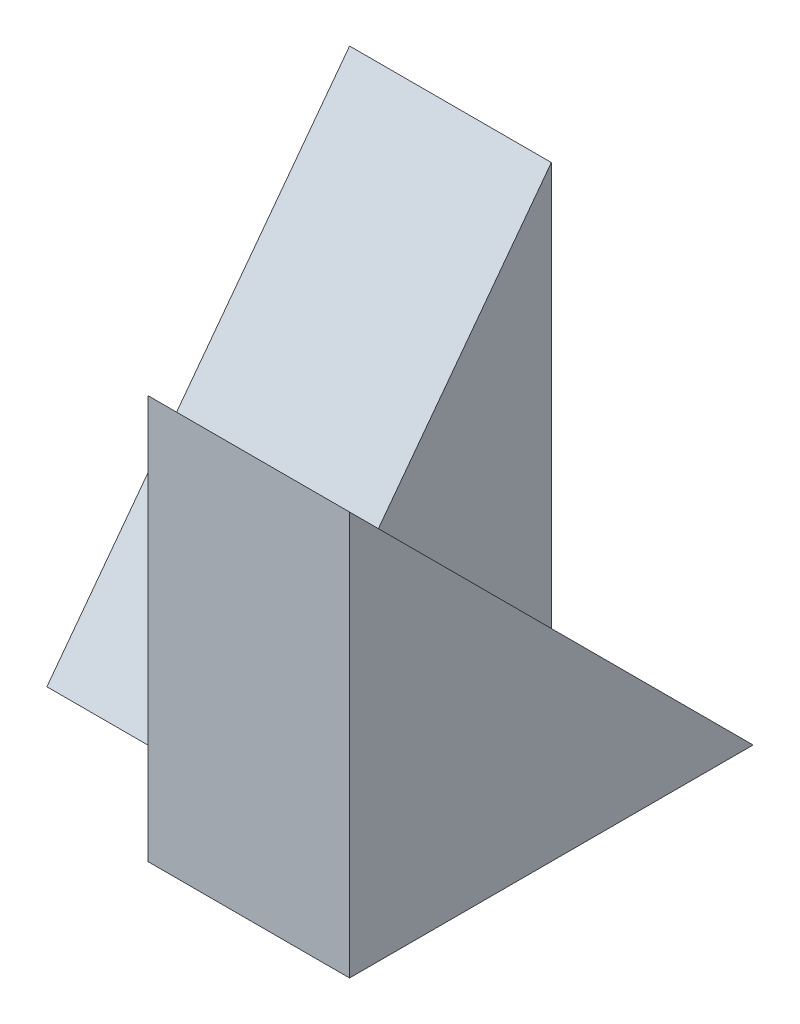
ISO-10303-21;
HEADER;
FILE_DESCRIPTION(('STEP AP214'),'2;1');
FILE_NAME('part.step','',(''),(''),'','','');
FILE_SCHEMA(('AUTOMOTIVE_DESIGN { 1 0 10303 214 1 1 1 1 }'));
ENDSEC;
DATA;
#1=APPLICATION_CONTEXT('core data for automotive mechanical design processes');
#2=APPLICATION_PROTOCOL_DEFINITION('international standard','automotive_design',2000,#1);
#3=PRODUCT_CONTEXT('',#1,'mechanical');
#4=PRODUCT('Part','Part','',(#3));
#5=PRODUCT_RELATED_PRODUCT_CATEGORY('part','',(#4));
#6=PRODUCT_DEFINITION_FORMATION('','',#4);
#7=PRODUCT_DEFINITION_CONTEXT('part definition',#1,'design');
#8=PRODUCT_DEFINITION('design','',#6,#7);
#9=PRODUCT_DEFINITION_SHAPE('','',#8);
#10=(LENGTH_UNIT() NAMED_UNIT(*) SI_UNIT(.MILLI.,.METRE.));
#11=(NAMED_UNIT(*) PLANE_ANGLE_UNIT() SI_UNIT($,.RADIAN.));
#12=(NAMED_UNIT(*) SI_UNIT($,.STERADIAN.) SOLID_ANGLE_UNIT());
#13=UNCERTAINTY_MEASURE_WITH_UNIT(LENGTH_MEASURE(1.E-05),#10,'distance_accuracy_value','');
#14=(GEOMETRIC_REPRESENTATION_CONTEXT(3) GLOBAL_UNCERTAINTY_ASSIGNED_CONTEXT((#13)) GLOBAL_UNIT_ASSIGNED_CONTEXT((#10,
#11,#12)) REPRESENTATION_CONTEXT('',''));
#15=CARTESIAN_POINT('',(0.,0.,0.));
#16=DIRECTION('',(0.,0.,1.));
#17=DIRECTION('',(1.,0.,0.));
#18=AXIS2_PLACEMENT_3D('',#15,#16,#17);
#19=CARTESIAN_POINT('',(2.,0.,-4.));
#20=DIRECTION('',(0.,0.,1.));
#21=DIRECTION('',(1.,0.,0.));
#22=AXIS2_PLACEMENT_3D('',#19,#20,#21);
#23=PLANE('',#22);
#24=DIRECTION('',(0.,1.,0.));
#25=VECTOR('',#24,1.);
#26=CARTESIAN_POINT('',(0.,4.,-4.));
#27=LINE('',#26,#25);
#28=CARTESIAN_POINT('',(0.,0.,-4.));
#29=VERTEX_POINT('',#28);
#30=CARTESIAN_POINT('',(0.,4.,-4.));
#31=VERTEX_POINT('',#30);
#32=EDGE_CURVE('E97',#29,#31,#27,.T.);
#33=ORIENTED_EDGE('',*,*,#32,.F.);
#34=DIRECTION('',(-1.,0.,0.));
#35=VECTOR('',#34,1.);
#36=CARTESIAN_POINT('',(2.,0.,-4.));
#37=LINE('',#36,#35);
#38=CARTESIAN_POINT('',(-2.,0.,-4.));
#39=VERTEX_POINT('',#38);
#40=EDGE_CURVE('E107',#29,#39,#37,.T.);
#41=ORIENTED_EDGE('',*,*,#40,.T.);
#42=DIRECTION('',(0.,-1.,0.));
#43=VECTOR('',#42,1.);
#44=CARTESIAN_POINT('',(-2.,4.,-4.));
#45=LINE('',#44,#43);
#46=CARTESIAN_POINT('',(-2.,4.,-4.));
#47=VERTEX_POINT('',#46);
#48=EDGE_CURVE('E106',#47,#39,#45,.T.);
#49=ORIENTED_EDGE('',*,*,#48,.F.);
#50=DIRECTION('',(-1.,0.,0.));
#51=VECTOR('',#50,1.);
#52=CARTESIAN_POINT('',(2.,4.,-4.));
#53=LINE('',#52,#51);
#54=EDGE_CURVE('E90',#31,#47,#53,.T.);
#55=ORIENTED_EDGE('',*,*,#54,.F.);
#56=EDGE_LOOP('',(#33,#41,#49,#55));
#57=FACE_BOUND('',#56,.T.);
#58=ADVANCED_FACE('F33',(#57),#23,.F.);
#59=CARTESIAN_POINT('',(2.,0.,0.));
#60=DIRECTION('',(0.,0.,-1.));
#61=DIRECTION('',(-1.,0.,0.));
#62=AXIS2_PLACEMENT_3D('',#59,#60,#61);
#63=PLANE('',#62);
#64=DIRECTION('',(0.,-1.,0.));
#65=VECTOR('',#64,1.);
#66=CARTESIAN_POINT('',(0.,0.,0.));
#67=LINE('',#66,#65);
#68=CARTESIAN_POINT('',(0.,3.99999999999996,0.));
#69=VERTEX_POINT('',#68);
#70=CARTESIAN_POINT('',(0.,0.,0.));
#71=VERTEX_POINT('',#70);
#72=EDGE_CURVE('E119',#69,#71,#67,.T.);
#73=ORIENTED_EDGE('',*,*,#72,.T.);
#74=DIRECTION('',(-1.,0.,0.));
#75=VECTOR('',#74,1.);
#76=CARTESIAN_POINT('',(2.,0.,0.));
#77=LINE('',#76,#75);
#78=CARTESIAN_POINT('',(2.,0.,0.));
#79=VERTEX_POINT('',#78);
#80=EDGE_CURVE('E11',#79,#71,#77,.T.);
#81=ORIENTED_EDGE('',*,*,#80,.F.);
#82=DIRECTION('',(0.,-1.,0.));
#83=VECTOR('',#82,1.);
#84=CARTESIAN_POINT('',(2.,0.,0.));
#85=LINE('',#84,#83);
#86=CARTESIAN_POINT('',(2.,3.99999999999996,0.));
#87=VERTEX_POINT('',#86);
#88=EDGE_CURVE('E118',#87,#79,#85,.T.);
#89=ORIENTED_EDGE('',*,*,#88,.F.);
#90=DIRECTION('',(-1.,0.,0.));
#91=VECTOR('',#90,1.);
#92=CARTESIAN_POINT('',(2.,4.,0.));
#93=LINE('',#92,#91);
#94=EDGE_CURVE('E108',#87,#69,#93,.T.);
#95=ORIENTED_EDGE('',*,*,#94,.T.);
#96=EDGE_LOOP('',(#73,#81,#89,#95));
#97=FACE_BOUND('',#96,.T.);
#98=ADVANCED_FACE('F35',(#97),#63,.F.);
#99=CARTESIAN_POINT('',(2.,0.,0.));
#100=DIRECTION('',(0.,1.,0.));
#101=DIRECTION('',(0.,0.,1.));
#102=AXIS2_PLACEMENT_3D('',#99,#100,#101);
#103=PLANE('',#102);
#104=DIRECTION('',(0.,0.,-1.));
#105=VECTOR('',#104,1.);
#106=CARTESIAN_POINT('',(0.,0.,0.));
#107=LINE('',#106,#105);
#108=CARTESIAN_POINT('',(0.,0.,-1.));
#109=VERTEX_POINT('',#108);
#110=EDGE_CURVE('E115',#71,#109,#107,.T.);
#111=ORIENTED_EDGE('',*,*,#110,.T.);
#112=DIRECTION('',(1.,0.,0.));
#113=VECTOR('',#112,1.);
#114=CARTESIAN_POINT('',(-2.,0.,-1.));
#115=LINE('',#114,#113);
#116=CARTESIAN_POINT('',(-2.,0.,-1.));
#117=VERTEX_POINT('',#116);
#118=EDGE_CURVE('E120',#117,#109,#115,.T.);
#119=ORIENTED_EDGE('',*,*,#118,.F.);
#120=DIRECTION('',(0.,0.,1.));
#121=VECTOR('',#120,1.);
#122=CARTESIAN_POINT('',(-2.,0.,-4.));
#123=LINE('',#122,#121);
#124=EDGE_CURVE('E128',#39,#117,#123,.T.);
#125=ORIENTED_EDGE('',*,*,#124,.F.);
#126=ORIENTED_EDGE('',*,*,#40,.F.);
#127=CARTESIAN_POINT('',(2.,0.,-4.));
#128=VERTEX_POINT('',#127);
#129=EDGE_CURVE('E44',#128,#29,#37,.T.);
#130=ORIENTED_EDGE('',*,*,#129,.F.);
#131=DIRECTION('',(0.,0.,-1.));
#132=VECTOR('',#131,1.);
#133=CARTESIAN_POINT('',(2.,0.,0.));
#134=LINE('',#133,#132);
#135=EDGE_CURVE('E50',#79,#128,#134,.T.);
#136=ORIENTED_EDGE('',*,*,#135,.F.);
#137=ORIENTED_EDGE('',*,*,#80,.T.);
#138=EDGE_LOOP('',(#111,#119,#125,#126,#130,#136,#137));
#139=FACE_BOUND('',#138,.T.);
#140=ADVANCED_FACE('F141',(#139),#103,.F.);
#141=CARTESIAN_POINT('',(2.,0.,0.));
#142=DIRECTION('',(-1.,0.,0.));
#143=DIRECTION('',(0.,0.,1.));
#144=AXIS2_PLACEMENT_3D('',#141,#142,#143);
#145=PLANE('',#144);
#146=ORIENTED_EDGE('',*,*,#135,.T.);
#147=DIRECTION('',(0.,-0.707106781186544,-0.707106781186551));
#148=VECTOR('',#147,1.);
#149=CARTESIAN_POINT('',(2.,0.,-4.));
#150=LINE('',#149,#148);
#151=EDGE_CURVE('E95',#87,#128,#150,.T.);
#152=ORIENTED_EDGE('',*,*,#151,.F.);
#153=ORIENTED_EDGE('',*,*,#88,.T.);
#154=EDGE_LOOP('',(#146,#152,#153));
#155=FACE_BOUND('',#154,.T.);
#156=ADVANCED_FACE('F149',(#155),#145,.F.);
#157=CARTESIAN_POINT('',(0.,0.,0.));
#158=DIRECTION('',(-1.,0.,0.));
#159=DIRECTION('',(0.,0.,1.));
#160=AXIS2_PLACEMENT_3D('',#157,#158,#159);
#161=PLANE('',#160);
#162=DIRECTION('',(0.,-0.707106781186544,-0.707106781186551));
#163=VECTOR('',#162,1.);
#164=CARTESIAN_POINT('',(0.,0.,-4.));
#165=LINE('',#164,#163);
#166=CARTESIAN_POINT('',(0.,1.7142857142857,-2.28571428571428));
#167=VERTEX_POINT('',#166);
#168=EDGE_CURVE('E131',#69,#167,#165,.T.);
#169=ORIENTED_EDGE('',*,*,#168,.T.);
#170=DIRECTION('',(0.,-0.8,0.6));
#171=VECTOR('',#170,1.);
#172=CARTESIAN_POINT('',(0.,0.,-1.));
#173=LINE('',#172,#171);
#174=EDGE_CURVE('E37',#167,#109,#173,.T.);
#175=ORIENTED_EDGE('',*,*,#174,.T.);
#176=ORIENTED_EDGE('',*,*,#110,.F.);
#177=ORIENTED_EDGE('',*,*,#72,.F.);
#178=EDGE_LOOP('',(#169,#175,#176,#177));
#179=FACE_BOUND('',#178,.T.);
#180=ADVANCED_FACE('F137',(#179),#161,.T.);
#181=CARTESIAN_POINT('',(-2.,0.,0.));
#182=DIRECTION('',(-1.,0.,0.));
#183=DIRECTION('',(0.,0.,1.));
#184=AXIS2_PLACEMENT_3D('',#181,#182,#183);
#185=PLANE('',#184);
#186=DIRECTION('',(0.,-0.8,0.6));
#187=VECTOR('',#186,1.);
#188=CARTESIAN_POINT('',(-2.,0.,-1.));
#189=LINE('',#188,#187);
#190=EDGE_CURVE('E134',#47,#117,#189,.T.);
#191=ORIENTED_EDGE('',*,*,#190,.F.);
#192=ORIENTED_EDGE('',*,*,#48,.T.);
#193=ORIENTED_EDGE('',*,*,#124,.T.);
#194=EDGE_LOOP('',(#191,#192,#193));
#195=FACE_BOUND('',#194,.T.);
#196=ADVANCED_FACE('F151',(#195),#185,.T.);
#197=CARTESIAN_POINT('',(0.,0.,0.));
#198=DIRECTION('',(1.,0.,0.));
#199=DIRECTION('',(0.,0.,-1.));
#200=AXIS2_PLACEMENT_3D('',#197,#198,#199);
#201=PLANE('',#200);
#202=EDGE_CURVE('E86',#31,#167,#173,.T.);
#203=ORIENTED_EDGE('',*,*,#202,.T.);
#204=EDGE_CURVE('E99',#167,#29,#165,.T.);
#205=ORIENTED_EDGE('',*,*,#204,.T.);
#206=ORIENTED_EDGE('',*,*,#32,.T.);
#207=EDGE_LOOP('',(#203,#205,#206));
#208=FACE_BOUND('',#207,.T.);
#209=ADVANCED_FACE('F98',(#208),#201,.T.);
#210=CARTESIAN_POINT('',(0.,0.,-4.));
#211=DIRECTION('',(0.,-0.707106781186551,0.707106781186544));
#212=DIRECTION('',(0.,-0.707106781186544,-0.707106781186551));
#213=AXIS2_PLACEMENT_3D('',#210,#211,#212);
#214=PLANE('',#213);
#215=ORIENTED_EDGE('',*,*,#151,.T.);
#216=ORIENTED_EDGE('',*,*,#129,.T.);
#217=ORIENTED_EDGE('',*,*,#204,.F.);
#218=ORIENTED_EDGE('',*,*,#168,.F.);
#219=ORIENTED_EDGE('',*,*,#94,.F.);
#220=EDGE_LOOP('',(#215,#216,#217,#218,#219));
#221=FACE_BOUND('',#220,.T.);
#222=ADVANCED_FACE('F147',(#221),#214,.F.);
#223=CARTESIAN_POINT('',(0.,0.,-1.));
#224=DIRECTION('',(0.,-0.6,-0.8));
#225=DIRECTION('',(0.,0.8,-0.6));
#226=AXIS2_PLACEMENT_3D('',#223,#224,#225);
#227=PLANE('',#226);
#228=ORIENTED_EDGE('',*,*,#190,.T.);
#229=ORIENTED_EDGE('',*,*,#118,.T.);
#230=ORIENTED_EDGE('',*,*,#174,.F.);
#231=ORIENTED_EDGE('',*,*,#202,.F.);
#232=ORIENTED_EDGE('',*,*,#54,.T.);
#233=EDGE_LOOP('',(#228,#229,#230,#231,#232));
#234=FACE_BOUND('',#233,.T.);
#235=ADVANCED_FACE('F88',(#234),#227,.F.);
#236=CLOSED_SHELL('',(#58,#98,#140,#156,#180,#196,#209,#222,#235));
#237=MANIFOLD_SOLID_BREP('B2',#236);
#238=ADVANCED_BREP_SHAPE_REPRESENTATION('',(#18,#237),#14);
#239=SHAPE_DEFINITION_REPRESENTATION(#9,#238);
ENDSEC;
END-ISO-10303-21;
